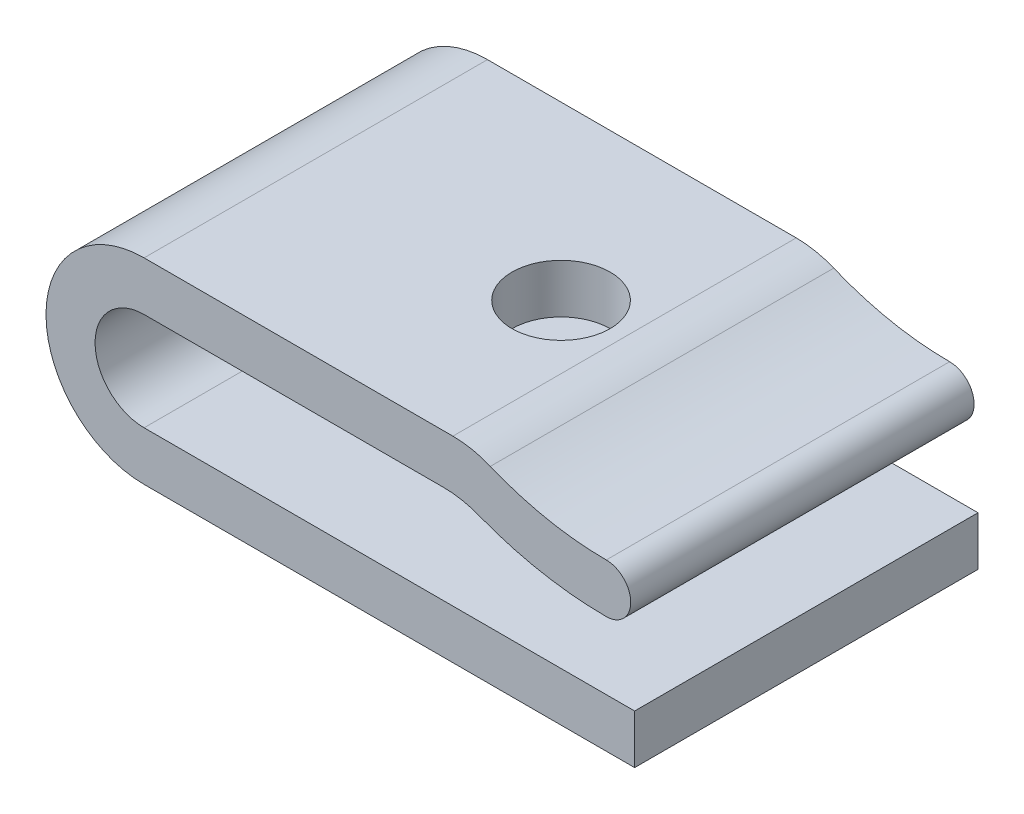
ISO-10303-21;
HEADER;
FILE_DESCRIPTION(('STEP AP214'),'2;1');
FILE_NAME('part.step','',(''),(''),'','','');
FILE_SCHEMA(('AUTOMOTIVE_DESIGN { 1 0 10303 214 1 1 1 1 }'));
ENDSEC;
DATA;
#1=APPLICATION_CONTEXT('core data for automotive mechanical design processes');
#2=APPLICATION_PROTOCOL_DEFINITION('international standard','automotive_design',2000,#1);
#3=PRODUCT_CONTEXT('',#1,'mechanical');
#4=PRODUCT('Part','Part','',(#3));
#5=PRODUCT_RELATED_PRODUCT_CATEGORY('part','',(#4));
#6=PRODUCT_DEFINITION_FORMATION('','',#4);
#7=PRODUCT_DEFINITION_CONTEXT('part definition',#1,'design');
#8=PRODUCT_DEFINITION('design','',#6,#7);
#9=PRODUCT_DEFINITION_SHAPE('','',#8);
#10=(LENGTH_UNIT() NAMED_UNIT(*) SI_UNIT(.MILLI.,.METRE.));
#11=(NAMED_UNIT(*) PLANE_ANGLE_UNIT() SI_UNIT($,.RADIAN.));
#12=(NAMED_UNIT(*) SI_UNIT($,.STERADIAN.) SOLID_ANGLE_UNIT());
#13=UNCERTAINTY_MEASURE_WITH_UNIT(LENGTH_MEASURE(1.E-05),#10,'distance_accuracy_value','');
#14=(GEOMETRIC_REPRESENTATION_CONTEXT(3) GLOBAL_UNCERTAINTY_ASSIGNED_CONTEXT((#13)) GLOBAL_UNIT_ASSIGNED_CONTEXT((#10,
#11,#12)) REPRESENTATION_CONTEXT('',''));
#15=CARTESIAN_POINT('',(0.,0.,0.));
#16=DIRECTION('',(0.,0.,1.));
#17=DIRECTION('',(1.,0.,0.));
#18=AXIS2_PLACEMENT_3D('',#15,#16,#17);
#19=CARTESIAN_POINT('',(-1.15809283542679,3.75490759326914,14.));
#20=DIRECTION('',(0.,0.,-1.));
#21=DIRECTION('',(-1.,0.,0.));
#22=AXIS2_PLACEMENT_3D('',#19,#20,#21);
#23=CYLINDRICAL_SURFACE('',#22,1.);
#24=CARTESIAN_POINT('',(-1.15809283542679,3.75490759326914,0.));
#25=DIRECTION('',(0.,0.,1.));
#26=DIRECTION('',(1.,0.,0.));
#27=AXIS2_PLACEMENT_3D('',#24,#25,#26);
#28=CIRCLE('',#27,1.);
#29=CARTESIAN_POINT('',(-1.156703262137,4.75490662781171,0.));
#30=VERTEX_POINT('',#29);
#31=CARTESIAN_POINT('',(-1.15948240871658,2.75490855872657,0.));
#32=VERTEX_POINT('',#31);
#33=EDGE_CURVE('E151',#30,#32,#28,.F.);
#34=ORIENTED_EDGE('',*,*,#33,.F.);
#35=DIRECTION('',(0.,0.,-1.));
#36=VECTOR('',#35,1.);
#37=CARTESIAN_POINT('',(-1.156703262137,4.75490662781171,14.));
#38=LINE('',#37,#36);
#39=CARTESIAN_POINT('',(-1.156703262137,4.75490662781171,14.));
#40=VERTEX_POINT('',#39);
#41=EDGE_CURVE('E11',#40,#30,#38,.T.);
#42=ORIENTED_EDGE('',*,*,#41,.F.);
#43=CARTESIAN_POINT('',(-1.15809283542679,3.75490759326914,14.));
#44=DIRECTION('',(0.,0.,1.));
#45=DIRECTION('',(1.,0.,0.));
#46=AXIS2_PLACEMENT_3D('',#43,#44,#45);
#47=CIRCLE('',#46,1.);
#48=CARTESIAN_POINT('',(-1.15948240871658,2.75490855872657,14.));
#49=VERTEX_POINT('',#48);
#50=EDGE_CURVE('E182',#40,#49,#47,.F.);
#51=ORIENTED_EDGE('',*,*,#50,.T.);
#52=DIRECTION('',(0.,0.,-1.));
#53=VECTOR('',#52,1.);
#54=CARTESIAN_POINT('',(-1.15948240871658,2.75490855872657,14.));
#55=LINE('',#54,#53);
#56=EDGE_CURVE('E96',#49,#32,#55,.T.);
#57=ORIENTED_EDGE('',*,*,#56,.T.);
#58=EDGE_LOOP('',(#34,#42,#51,#57));
#59=FACE_BOUND('',#58,.T.);
#60=ADVANCED_FACE('F33',(#59),#23,.T.);
#61=CARTESIAN_POINT('',(-1.13945175123292,17.1698647844746,14.));
#62=DIRECTION('',(0.,0.,-1.));
#63=DIRECTION('',(-1.,0.,0.));
#64=AXIS2_PLACEMENT_3D('',#61,#62,#63);
#65=CYLINDRICAL_SURFACE('',#64,12.414970142788);
#66=CARTESIAN_POINT('',(-1.13945175123292,17.1698647844746,0.));
#67=DIRECTION('',(0.,0.,1.));
#68=DIRECTION('',(1.,0.,0.));
#69=AXIS2_PLACEMENT_3D('',#66,#67,#68);
#70=CIRCLE('',#69,12.414970142788);
#71=CARTESIAN_POINT('',(-5.88239511938709,5.69659272055137,0.));
#72=VERTEX_POINT('',#71);
#73=EDGE_CURVE('E154',#72,#30,#70,.T.);
#74=ORIENTED_EDGE('',*,*,#73,.F.);
#75=DIRECTION('',(0.,0.,-1.));
#76=VECTOR('',#75,1.);
#77=CARTESIAN_POINT('',(-5.88239511938709,5.69659272055137,14.));
#78=LINE('',#77,#76);
#79=CARTESIAN_POINT('',(-5.88239511938709,5.69659272055137,14.));
#80=VERTEX_POINT('',#79);
#81=EDGE_CURVE('E42',#80,#72,#78,.T.);
#82=ORIENTED_EDGE('',*,*,#81,.F.);
#83=CARTESIAN_POINT('',(-1.13945175123292,17.1698647844746,14.));
#84=DIRECTION('',(0.,0.,1.));
#85=DIRECTION('',(1.,0.,0.));
#86=AXIS2_PLACEMENT_3D('',#83,#84,#85);
#87=CIRCLE('',#86,12.414970142788);
#88=EDGE_CURVE('E213',#80,#40,#87,.T.);
#89=ORIENTED_EDGE('',*,*,#88,.T.);
#90=ORIENTED_EDGE('',*,*,#41,.T.);
#91=EDGE_LOOP('',(#74,#82,#89,#90));
#92=FACE_BOUND('',#91,.T.);
#93=ADVANCED_FACE('F212',(#92),#65,.F.);
#94=CARTESIAN_POINT('',(-7.41053197790684,2.,14.));
#95=DIRECTION('',(0.,0.,-1.));
#96=DIRECTION('',(-1.,0.,0.));
#97=AXIS2_PLACEMENT_3D('',#94,#95,#96);
#98=CYLINDRICAL_SURFACE('',#97,4.);
#99=CARTESIAN_POINT('',(-7.41053197790684,2.,0.));
#100=DIRECTION('',(0.,0.,1.));
#101=DIRECTION('',(1.,0.,0.));
#102=AXIS2_PLACEMENT_3D('',#99,#100,#101);
#103=CIRCLE('',#102,4.);
#104=CARTESIAN_POINT('',(-7.41053197790684,6.,0.));
#105=VERTEX_POINT('',#104);
#106=EDGE_CURVE('E158',#72,#105,#103,.T.);
#107=ORIENTED_EDGE('',*,*,#106,.T.);
#108=DIRECTION('',(0.,0.,-1.));
#109=VECTOR('',#108,1.);
#110=CARTESIAN_POINT('',(-7.41053197790684,6.,14.));
#111=LINE('',#110,#109);
#112=CARTESIAN_POINT('',(-7.41053197790684,6.,14.));
#113=VERTEX_POINT('',#112);
#114=EDGE_CURVE('E197',#113,#105,#111,.T.);
#115=ORIENTED_EDGE('',*,*,#114,.F.);
#116=CARTESIAN_POINT('',(-7.41053197790684,2.,14.));
#117=DIRECTION('',(0.,0.,1.));
#118=DIRECTION('',(1.,0.,0.));
#119=AXIS2_PLACEMENT_3D('',#116,#117,#118);
#120=CIRCLE('',#119,4.);
#121=EDGE_CURVE('E204',#80,#113,#120,.T.);
#122=ORIENTED_EDGE('',*,*,#121,.F.);
#123=ORIENTED_EDGE('',*,*,#81,.T.);
#124=EDGE_LOOP('',(#107,#115,#122,#123));
#125=FACE_BOUND('',#124,.T.);
#126=ADVANCED_FACE('F202',(#125),#98,.T.);
#127=CARTESIAN_POINT('',(0.,6.,14.));
#128=DIRECTION('',(0.,1.,0.));
#129=DIRECTION('',(-1.,0.,0.));
#130=AXIS2_PLACEMENT_3D('',#127,#128,#129);
#131=PLANE('',#130);
#132=CARTESIAN_POINT('',(-10.,6.,7.));
#133=DIRECTION('',(0.,-1.,0.));
#134=DIRECTION('',(0.,0.,-1.));
#135=AXIS2_PLACEMENT_3D('',#132,#133,#134);
#136=CIRCLE('',#135,2.);
#137=CARTESIAN_POINT('',(-10.,6.,5.));
#138=VERTEX_POINT('',#137);
#139=EDGE_CURVE('E392',#138,#138,#136,.T.);
#140=ORIENTED_EDGE('',*,*,#139,.T.);
#141=EDGE_LOOP('',(#140));
#142=FACE_BOUND('',#141,.T.);
#143=DIRECTION('',(1.,0.,0.));
#144=VECTOR('',#143,1.);
#145=CARTESIAN_POINT('',(0.,6.,0.));
#146=LINE('',#145,#144);
#147=CARTESIAN_POINT('',(-20.,6.,0.));
#148=VERTEX_POINT('',#147);
#149=EDGE_CURVE('E161',#148,#105,#146,.T.);
#150=ORIENTED_EDGE('',*,*,#149,.F.);
#151=DIRECTION('',(0.,0.,-1.));
#152=VECTOR('',#151,1.);
#153=CARTESIAN_POINT('',(-20.,6.,14.));
#154=LINE('',#153,#152);
#155=CARTESIAN_POINT('',(-20.,6.,14.));
#156=VERTEX_POINT('',#155);
#157=EDGE_CURVE('E195',#156,#148,#154,.T.);
#158=ORIENTED_EDGE('',*,*,#157,.F.);
#159=DIRECTION('',(1.,0.,0.));
#160=VECTOR('',#159,1.);
#161=CARTESIAN_POINT('',(0.,6.,14.));
#162=LINE('',#161,#160);
#163=EDGE_CURVE('E221',#156,#113,#162,.T.);
#164=ORIENTED_EDGE('',*,*,#163,.T.);
#165=ORIENTED_EDGE('',*,*,#114,.T.);
#166=EDGE_LOOP('',(#150,#158,#164,#165));
#167=FACE_BOUND('',#166,.T.);
#168=ADVANCED_FACE('F256',(#142,#167),#131,.T.);
#169=CARTESIAN_POINT('',(-20.,2.,14.));
#170=DIRECTION('',(0.,0.,-1.));
#171=DIRECTION('',(-1.,0.,0.));
#172=AXIS2_PLACEMENT_3D('',#169,#170,#171);
#173=CYLINDRICAL_SURFACE('',#172,4.);
#174=CARTESIAN_POINT('',(-20.,2.,0.));
#175=DIRECTION('',(0.,0.,1.));
#176=DIRECTION('',(1.,0.,0.));
#177=AXIS2_PLACEMENT_3D('',#174,#175,#176);
#178=CIRCLE('',#177,4.);
#179=CARTESIAN_POINT('',(-20.,-2.,0.));
#180=VERTEX_POINT('',#179);
#181=EDGE_CURVE('E164',#180,#148,#178,.F.);
#182=ORIENTED_EDGE('',*,*,#181,.F.);
#183=DIRECTION('',(0.,0.,-1.));
#184=VECTOR('',#183,1.);
#185=CARTESIAN_POINT('',(-20.,-2.,14.));
#186=LINE('',#185,#184);
#187=CARTESIAN_POINT('',(-20.,-2.,14.));
#188=VERTEX_POINT('',#187);
#189=EDGE_CURVE('E193',#188,#180,#186,.T.);
#190=ORIENTED_EDGE('',*,*,#189,.F.);
#191=CARTESIAN_POINT('',(-20.,2.,14.));
#192=DIRECTION('',(0.,0.,1.));
#193=DIRECTION('',(1.,0.,0.));
#194=AXIS2_PLACEMENT_3D('',#191,#192,#193);
#195=CIRCLE('',#194,4.);
#196=EDGE_CURVE('E224',#188,#156,#195,.F.);
#197=ORIENTED_EDGE('',*,*,#196,.T.);
#198=ORIENTED_EDGE('',*,*,#157,.T.);
#199=EDGE_LOOP('',(#182,#190,#197,#198));
#200=FACE_BOUND('',#199,.T.);
#201=ADVANCED_FACE('F252',(#200),#173,.T.);
#202=CARTESIAN_POINT('',(0.,-2.,14.));
#203=DIRECTION('',(0.,-1.,0.));
#204=DIRECTION('',(0.,0.,-1.));
#205=AXIS2_PLACEMENT_3D('',#202,#203,#204);
#206=PLANE('',#205);
#207=CARTESIAN_POINT('',(-10.,-2.,7.));
#208=DIRECTION('',(0.,-1.,0.));
#209=DIRECTION('',(0.,0.,-1.));
#210=AXIS2_PLACEMENT_3D('',#207,#208,#209);
#211=CIRCLE('',#210,2.);
#212=CARTESIAN_POINT('',(-10.,-2.,5.));
#213=VERTEX_POINT('',#212);
#214=EDGE_CURVE('E388',#213,#213,#211,.T.);
#215=ORIENTED_EDGE('',*,*,#214,.F.);
#216=EDGE_LOOP('',(#215));
#217=FACE_BOUND('',#216,.T.);
#218=DIRECTION('',(-1.,0.,0.));
#219=VECTOR('',#218,1.);
#220=CARTESIAN_POINT('',(0.,-2.,0.));
#221=LINE('',#220,#219);
#222=CARTESIAN_POINT('',(0.,-2.,0.));
#223=VERTEX_POINT('',#222);
#224=EDGE_CURVE('E167',#223,#180,#221,.T.);
#225=ORIENTED_EDGE('',*,*,#224,.F.);
#226=DIRECTION('',(0.,0.,-1.));
#227=VECTOR('',#226,1.);
#228=CARTESIAN_POINT('',(0.,-2.,14.));
#229=LINE('',#228,#227);
#230=CARTESIAN_POINT('',(0.,-2.,14.));
#231=VERTEX_POINT('',#230);
#232=EDGE_CURVE('E191',#231,#223,#229,.T.);
#233=ORIENTED_EDGE('',*,*,#232,.F.);
#234=DIRECTION('',(-1.,0.,0.));
#235=VECTOR('',#234,1.);
#236=CARTESIAN_POINT('',(0.,-2.,14.));
#237=LINE('',#236,#235);
#238=EDGE_CURVE('E227',#231,#188,#237,.T.);
#239=ORIENTED_EDGE('',*,*,#238,.T.);
#240=ORIENTED_EDGE('',*,*,#189,.T.);
#241=EDGE_LOOP('',(#225,#233,#239,#240));
#242=FACE_BOUND('',#241,.T.);
#243=ADVANCED_FACE('F249',(#217,#242),#206,.T.);
#244=CARTESIAN_POINT('',(0.,0.,14.));
#245=DIRECTION('',(1.,0.,0.));
#246=DIRECTION('',(0.,0.,-1.));
#247=AXIS2_PLACEMENT_3D('',#244,#245,#246);
#248=PLANE('',#247);
#249=DIRECTION('',(0.,-1.,0.));
#250=VECTOR('',#249,1.);
#251=CARTESIAN_POINT('',(0.,0.,0.));
#252=LINE('',#251,#250);
#253=CARTESIAN_POINT('',(0.,0.,0.));
#254=VERTEX_POINT('',#253);
#255=EDGE_CURVE('E170',#254,#223,#252,.T.);
#256=ORIENTED_EDGE('',*,*,#255,.F.);
#257=DIRECTION('',(0.,0.,-1.));
#258=VECTOR('',#257,1.);
#259=CARTESIAN_POINT('',(0.,0.,14.));
#260=LINE('',#259,#258);
#261=CARTESIAN_POINT('',(0.,0.,14.));
#262=VERTEX_POINT('',#261);
#263=EDGE_CURVE('E189',#262,#254,#260,.T.);
#264=ORIENTED_EDGE('',*,*,#263,.F.);
#265=DIRECTION('',(0.,-1.,0.));
#266=VECTOR('',#265,1.);
#267=CARTESIAN_POINT('',(0.,0.,14.));
#268=LINE('',#267,#266);
#269=EDGE_CURVE('E230',#262,#231,#268,.T.);
#270=ORIENTED_EDGE('',*,*,#269,.T.);
#271=ORIENTED_EDGE('',*,*,#232,.T.);
#272=EDGE_LOOP('',(#256,#264,#270,#271));
#273=FACE_BOUND('',#272,.T.);
#274=ADVANCED_FACE('F246',(#273),#248,.T.);
#275=CARTESIAN_POINT('',(0.,0.,14.));
#276=DIRECTION('',(0.,-1.,0.));
#277=DIRECTION('',(1.,0.,0.));
#278=AXIS2_PLACEMENT_3D('',#275,#276,#277);
#279=PLANE('',#278);
#280=CARTESIAN_POINT('',(-10.,0.,7.));
#281=DIRECTION('',(0.,-1.,0.));
#282=DIRECTION('',(1.,0.,0.));
#283=AXIS2_PLACEMENT_3D('',#280,#281,#282);
#284=CIRCLE('',#283,2.);
#285=CARTESIAN_POINT('',(-8.,0.,7.));
#286=VERTEX_POINT('',#285);
#287=EDGE_CURVE('E155',#286,#286,#284,.T.);
#288=ORIENTED_EDGE('',*,*,#287,.T.);
#289=EDGE_LOOP('',(#288));
#290=FACE_BOUND('',#289,.T.);
#291=DIRECTION('',(-1.,0.,0.));
#292=VECTOR('',#291,1.);
#293=CARTESIAN_POINT('',(0.,0.,0.));
#294=LINE('',#293,#292);
#295=CARTESIAN_POINT('',(-20.,0.,0.));
#296=VERTEX_POINT('',#295);
#297=EDGE_CURVE('E173',#254,#296,#294,.T.);
#298=ORIENTED_EDGE('',*,*,#297,.T.);
#299=DIRECTION('',(0.,0.,-1.));
#300=VECTOR('',#299,1.);
#301=CARTESIAN_POINT('',(-20.,0.,14.));
#302=LINE('',#301,#300);
#303=CARTESIAN_POINT('',(-20.,0.,14.));
#304=VERTEX_POINT('',#303);
#305=EDGE_CURVE('E186',#304,#296,#302,.T.);
#306=ORIENTED_EDGE('',*,*,#305,.F.);
#307=DIRECTION('',(-1.,0.,0.));
#308=VECTOR('',#307,1.);
#309=CARTESIAN_POINT('',(0.,0.,14.));
#310=LINE('',#309,#308);
#311=EDGE_CURVE('E233',#262,#304,#310,.T.);
#312=ORIENTED_EDGE('',*,*,#311,.F.);
#313=ORIENTED_EDGE('',*,*,#263,.T.);
#314=EDGE_LOOP('',(#298,#306,#312,#313));
#315=FACE_BOUND('',#314,.T.);
#316=ADVANCED_FACE('F239',(#290,#315),#279,.F.);
#317=CARTESIAN_POINT('',(-20.,2.,14.));
#318=DIRECTION('',(0.,0.,-1.));
#319=DIRECTION('',(-1.,0.,0.));
#320=AXIS2_PLACEMENT_3D('',#317,#318,#319);
#321=CYLINDRICAL_SURFACE('',#320,2.);
#322=CARTESIAN_POINT('',(-20.,2.,0.));
#323=DIRECTION('',(0.,0.,1.));
#324=DIRECTION('',(1.,0.,0.));
#325=AXIS2_PLACEMENT_3D('',#322,#323,#324);
#326=CIRCLE('',#325,2.);
#327=CARTESIAN_POINT('',(-20.,4.,0.));
#328=VERTEX_POINT('',#327);
#329=EDGE_CURVE('E175',#296,#328,#326,.F.);
#330=ORIENTED_EDGE('',*,*,#329,.T.);
#331=DIRECTION('',(0.,0.,-1.));
#332=VECTOR('',#331,1.);
#333=CARTESIAN_POINT('',(-20.,4.,14.));
#334=LINE('',#333,#332);
#335=CARTESIAN_POINT('',(-20.,4.,14.));
#336=VERTEX_POINT('',#335);
#337=EDGE_CURVE('E144',#336,#328,#334,.T.);
#338=ORIENTED_EDGE('',*,*,#337,.F.);
#339=CARTESIAN_POINT('',(-20.,2.,14.));
#340=DIRECTION('',(0.,0.,1.));
#341=DIRECTION('',(1.,0.,0.));
#342=AXIS2_PLACEMENT_3D('',#339,#340,#341);
#343=CIRCLE('',#342,2.);
#344=EDGE_CURVE('E131',#304,#336,#343,.F.);
#345=ORIENTED_EDGE('',*,*,#344,.F.);
#346=ORIENTED_EDGE('',*,*,#305,.T.);
#347=EDGE_LOOP('',(#330,#338,#345,#346));
#348=FACE_BOUND('',#347,.T.);
#349=ADVANCED_FACE('F243',(#348),#321,.F.);
#350=CARTESIAN_POINT('',(0.,4.,14.));
#351=DIRECTION('',(0.,1.,0.));
#352=DIRECTION('',(0.,0.,1.));
#353=AXIS2_PLACEMENT_3D('',#350,#351,#352);
#354=PLANE('',#353);
#355=CARTESIAN_POINT('',(-10.,4.,7.));
#356=DIRECTION('',(0.,1.,0.));
#357=DIRECTION('',(0.,0.,1.));
#358=AXIS2_PLACEMENT_3D('',#355,#356,#357);
#359=CIRCLE('',#358,2.);
#360=CARTESIAN_POINT('',(-10.,4.,9.));
#361=VERTEX_POINT('',#360);
#362=EDGE_CURVE('E36',#361,#361,#359,.T.);
#363=ORIENTED_EDGE('',*,*,#362,.T.);
#364=EDGE_LOOP('',(#363));
#365=FACE_BOUND('',#364,.T.);
#366=DIRECTION('',(1.,0.,0.));
#367=VECTOR('',#366,1.);
#368=CARTESIAN_POINT('',(0.,4.,0.));
#369=LINE('',#368,#367);
#370=CARTESIAN_POINT('',(-7.79579223551064,4.,0.));
#371=VERTEX_POINT('',#370);
#372=EDGE_CURVE('E140',#328,#371,#369,.T.);
#373=ORIENTED_EDGE('',*,*,#372,.T.);
#374=DIRECTION('',(0.,0.,-1.));
#375=VECTOR('',#374,1.);
#376=CARTESIAN_POINT('',(-7.79579223551064,4.,14.));
#377=LINE('',#376,#375);
#378=CARTESIAN_POINT('',(-7.79579223551064,4.,14.));
#379=VERTEX_POINT('',#378);
#380=EDGE_CURVE('E137',#379,#371,#377,.T.);
#381=ORIENTED_EDGE('',*,*,#380,.F.);
#382=DIRECTION('',(1.,0.,0.));
#383=VECTOR('',#382,1.);
#384=CARTESIAN_POINT('',(0.,4.,14.));
#385=LINE('',#384,#383);
#386=EDGE_CURVE('E125',#336,#379,#385,.T.);
#387=ORIENTED_EDGE('',*,*,#386,.F.);
#388=ORIENTED_EDGE('',*,*,#337,.T.);
#389=EDGE_LOOP('',(#373,#381,#387,#388));
#390=FACE_BOUND('',#389,.T.);
#391=ADVANCED_FACE('F138',(#365,#390),#354,.F.);
#392=CARTESIAN_POINT('',(-7.79579223551064,0.,14.));
#393=DIRECTION('',(0.,0.,-1.));
#394=DIRECTION('',(-1.,0.,0.));
#395=AXIS2_PLACEMENT_3D('',#392,#393,#394);
#396=CYLINDRICAL_SURFACE('',#395,4.);
#397=CARTESIAN_POINT('',(-7.79579223551064,0.,0.));
#398=DIRECTION('',(0.,0.,1.));
#399=DIRECTION('',(1.,0.,0.));
#400=AXIS2_PLACEMENT_3D('',#397,#398,#399);
#401=CIRCLE('',#400,4.);
#402=CARTESIAN_POINT('',(-6.34993803478915,3.72954496289508,0.));
#403=VERTEX_POINT('',#402);
#404=EDGE_CURVE('E178',#403,#371,#401,.T.);
#405=ORIENTED_EDGE('',*,*,#404,.F.);
#406=DIRECTION('',(0.,0.,-1.));
#407=VECTOR('',#406,1.);
#408=CARTESIAN_POINT('',(-6.34993803478915,3.72954496289508,14.));
#409=LINE('',#408,#407);
#410=CARTESIAN_POINT('',(-6.34993803478915,3.72954496289508,14.));
#411=VERTEX_POINT('',#410);
#412=EDGE_CURVE('E89',#411,#403,#409,.T.);
#413=ORIENTED_EDGE('',*,*,#412,.F.);
#414=CARTESIAN_POINT('',(-7.79579223551064,0.,14.));
#415=DIRECTION('',(0.,0.,1.));
#416=DIRECTION('',(1.,0.,0.));
#417=AXIS2_PLACEMENT_3D('',#414,#415,#416);
#418=CIRCLE('',#417,4.);
#419=EDGE_CURVE('E129',#411,#379,#418,.T.);
#420=ORIENTED_EDGE('',*,*,#419,.T.);
#421=ORIENTED_EDGE('',*,*,#380,.T.);
#422=EDGE_LOOP('',(#405,#413,#420,#421));
#423=FACE_BOUND('',#422,.T.);
#424=ADVANCED_FACE('F146',(#423),#396,.F.);
#425=CARTESIAN_POINT('',(-1.13945175123292,17.1698647844746,14.));
#426=DIRECTION('',(0.,0.,-1.));
#427=DIRECTION('',(-1.,0.,0.));
#428=AXIS2_PLACEMENT_3D('',#425,#426,#427);
#429=CYLINDRICAL_SURFACE('',#428,14.414970142788);
#430=CARTESIAN_POINT('',(-1.13945175123292,17.1698647844746,0.));
#431=DIRECTION('',(0.,0.,1.));
#432=DIRECTION('',(1.,0.,0.));
#433=AXIS2_PLACEMENT_3D('',#430,#431,#432);
#434=CIRCLE('',#433,14.414970142788);
#435=EDGE_CURVE('E180',#403,#32,#434,.T.);
#436=ORIENTED_EDGE('',*,*,#435,.T.);
#437=ORIENTED_EDGE('',*,*,#56,.F.);
#438=CARTESIAN_POINT('',(-1.13945175123292,17.1698647844746,14.));
#439=DIRECTION('',(0.,0.,1.));
#440=DIRECTION('',(1.,0.,0.));
#441=AXIS2_PLACEMENT_3D('',#438,#439,#440);
#442=CIRCLE('',#441,14.414970142788);
#443=EDGE_CURVE('E50',#411,#49,#442,.T.);
#444=ORIENTED_EDGE('',*,*,#443,.F.);
#445=ORIENTED_EDGE('',*,*,#412,.T.);
#446=EDGE_LOOP('',(#436,#437,#444,#445));
#447=FACE_BOUND('',#446,.T.);
#448=ADVANCED_FACE('F214',(#447),#429,.T.);
#449=CARTESIAN_POINT('',(0.,0.,14.));
#450=DIRECTION('',(0.,0.,1.));
#451=DIRECTION('',(1.,0.,0.));
#452=AXIS2_PLACEMENT_3D('',#449,#450,#451);
#453=PLANE('',#452);
#454=ORIENTED_EDGE('',*,*,#50,.F.);
#455=ORIENTED_EDGE('',*,*,#88,.F.);
#456=ORIENTED_EDGE('',*,*,#121,.T.);
#457=ORIENTED_EDGE('',*,*,#163,.F.);
#458=ORIENTED_EDGE('',*,*,#196,.F.);
#459=ORIENTED_EDGE('',*,*,#238,.F.);
#460=ORIENTED_EDGE('',*,*,#269,.F.);
#461=ORIENTED_EDGE('',*,*,#311,.T.);
#462=ORIENTED_EDGE('',*,*,#344,.T.);
#463=ORIENTED_EDGE('',*,*,#386,.T.);
#464=ORIENTED_EDGE('',*,*,#419,.F.);
#465=ORIENTED_EDGE('',*,*,#443,.T.);
#466=EDGE_LOOP('',(#454,#455,#456,#457,#458,#459,#460,#461,#462,#463,#464,#465));
#467=FACE_BOUND('',#466,.T.);
#468=ADVANCED_FACE('F127',(#467),#453,.T.);
#469=CARTESIAN_POINT('',(0.,0.,0.));
#470=DIRECTION('',(0.,0.,1.));
#471=DIRECTION('',(1.,0.,0.));
#472=AXIS2_PLACEMENT_3D('',#469,#470,#471);
#473=PLANE('',#472);
#474=ORIENTED_EDGE('',*,*,#33,.T.);
#475=ORIENTED_EDGE('',*,*,#435,.F.);
#476=ORIENTED_EDGE('',*,*,#404,.T.);
#477=ORIENTED_EDGE('',*,*,#372,.F.);
#478=ORIENTED_EDGE('',*,*,#329,.F.);
#479=ORIENTED_EDGE('',*,*,#297,.F.);
#480=ORIENTED_EDGE('',*,*,#255,.T.);
#481=ORIENTED_EDGE('',*,*,#224,.T.);
#482=ORIENTED_EDGE('',*,*,#181,.T.);
#483=ORIENTED_EDGE('',*,*,#149,.T.);
#484=ORIENTED_EDGE('',*,*,#106,.F.);
#485=ORIENTED_EDGE('',*,*,#73,.T.);
#486=EDGE_LOOP('',(#474,#475,#476,#477,#478,#479,#480,#481,#482,#483,#484,#485));
#487=FACE_BOUND('',#486,.T.);
#488=ADVANCED_FACE('F210',(#487),#473,.F.);
#489=CARTESIAN_POINT('',(-10.,6.,7.));
#490=DIRECTION('',(0.,-1.,0.));
#491=DIRECTION('',(0.,0.,-1.));
#492=AXIS2_PLACEMENT_3D('',#489,#490,#491);
#493=CYLINDRICAL_SURFACE('',#492,2.);
#494=ORIENTED_EDGE('',*,*,#139,.F.);
#495=EDGE_LOOP('',(#494));
#496=FACE_BOUND('',#495,.T.);
#497=ORIENTED_EDGE('',*,*,#362,.F.);
#498=EDGE_LOOP('',(#497));
#499=FACE_BOUND('',#498,.T.);
#500=ADVANCED_FACE('F338',(#496,#499),#493,.F.);
#501=ORIENTED_EDGE('',*,*,#214,.T.);
#502=EDGE_LOOP('',(#501));
#503=FACE_BOUND('',#502,.T.);
#504=ORIENTED_EDGE('',*,*,#287,.F.);
#505=EDGE_LOOP('',(#504));
#506=FACE_BOUND('',#505,.T.);
#507=ADVANCED_FACE('F372',(#503,#506),#493,.F.);
#508=CLOSED_SHELL('',(#60,#93,#126,#168,#201,#243,#274,#316,#349,#391,#424,#448,#468,#488,#500,#507));
#509=MANIFOLD_SOLID_BREP('B2',#508);
#510=ADVANCED_BREP_SHAPE_REPRESENTATION('',(#18,#509),#14);
#511=SHAPE_DEFINITION_REPRESENTATION(#9,#510);
ENDSEC;
END-ISO-10303-21;
